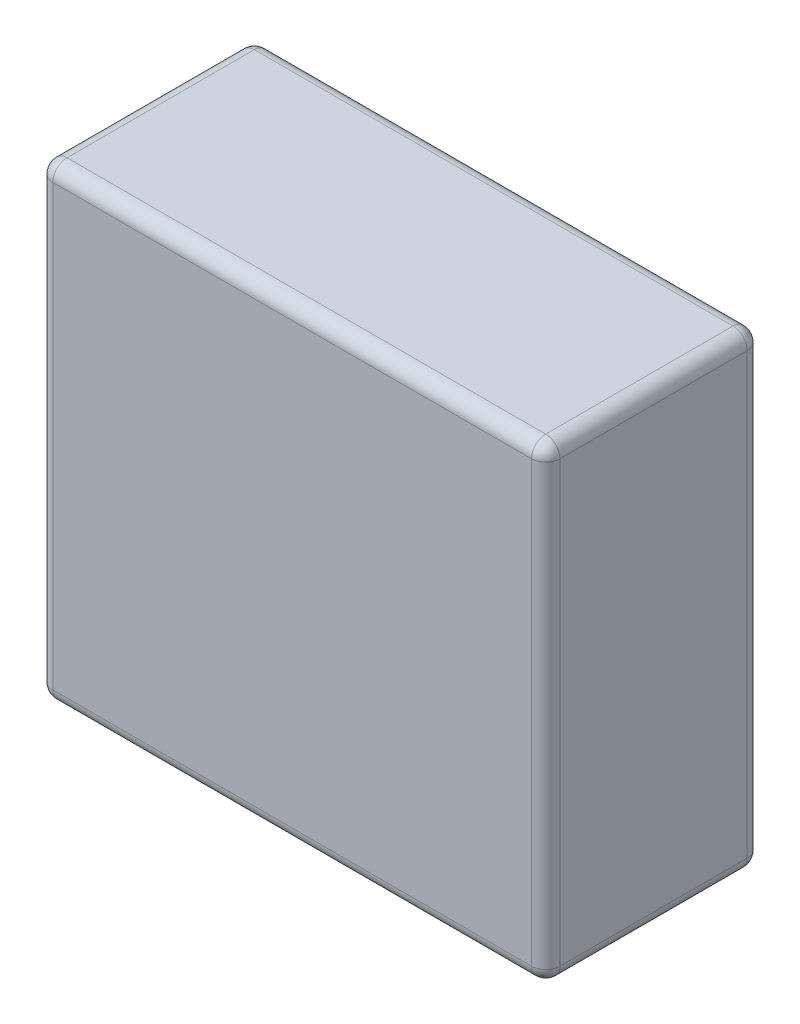
ISO-10303-21;
HEADER;
FILE_DESCRIPTION(('STEP AP214'),'2;1');
FILE_NAME('part.step','',(''),(''),'','','');
FILE_SCHEMA(('AUTOMOTIVE_DESIGN { 1 0 10303 214 1 1 1 1 }'));
ENDSEC;
DATA;
#1=APPLICATION_CONTEXT('core data for automotive mechanical design processes');
#2=APPLICATION_PROTOCOL_DEFINITION('international standard','automotive_design',2000,#1);
#3=PRODUCT_CONTEXT('',#1,'mechanical');
#4=PRODUCT('Part','Part','',(#3));
#5=PRODUCT_RELATED_PRODUCT_CATEGORY('part','',(#4));
#6=PRODUCT_DEFINITION_FORMATION('','',#4);
#7=PRODUCT_DEFINITION_CONTEXT('part definition',#1,'design');
#8=PRODUCT_DEFINITION('design','',#6,#7);
#9=PRODUCT_DEFINITION_SHAPE('','',#8);
#10=(LENGTH_UNIT() NAMED_UNIT(*) SI_UNIT(.MILLI.,.METRE.));
#11=(NAMED_UNIT(*) PLANE_ANGLE_UNIT() SI_UNIT($,.RADIAN.));
#12=(NAMED_UNIT(*) SI_UNIT($,.STERADIAN.) SOLID_ANGLE_UNIT());
#13=UNCERTAINTY_MEASURE_WITH_UNIT(LENGTH_MEASURE(1.E-05),#10,'distance_accuracy_value','');
#14=(GEOMETRIC_REPRESENTATION_CONTEXT(3) GLOBAL_UNCERTAINTY_ASSIGNED_CONTEXT((#13)) GLOBAL_UNIT_ASSIGNED_CONTEXT((#10,
#11,#12)) REPRESENTATION_CONTEXT('',''));
#15=CARTESIAN_POINT('',(0.,0.,0.));
#16=DIRECTION('',(0.,0.,1.));
#17=DIRECTION('',(1.,0.,0.));
#18=AXIS2_PLACEMENT_3D('',#15,#16,#17);
#19=CARTESIAN_POINT('',(181.,0.,0.));
#20=DIRECTION('',(0.,0.,-1.));
#21=DIRECTION('',(-1.,0.,0.));
#22=AXIS2_PLACEMENT_3D('',#19,#20,#21);
#23=PLANE('',#22);
#24=DIRECTION('',(0.,-1.,0.));
#25=VECTOR('',#24,1.);
#26=CARTESIAN_POINT('',(5.08,0.,0.));
#27=LINE('',#26,#25);
#28=CARTESIAN_POINT('',(5.08,161.92,0.));
#29=VERTEX_POINT('',#28);
#30=CARTESIAN_POINT('',(5.08,5.08,0.));
#31=VERTEX_POINT('',#30);
#32=EDGE_CURVE('E221',#29,#31,#27,.T.);
#33=ORIENTED_EDGE('',*,*,#32,.T.);
#34=DIRECTION('',(-1.,0.,0.));
#35=VECTOR('',#34,1.);
#36=CARTESIAN_POINT('',(181.,5.08,0.));
#37=LINE('',#36,#35);
#38=CARTESIAN_POINT('',(175.92,5.08,0.));
#39=VERTEX_POINT('',#38);
#40=EDGE_CURVE('E232',#31,#39,#37,.F.);
#41=ORIENTED_EDGE('',*,*,#40,.T.);
#42=DIRECTION('',(0.,-1.,0.));
#43=VECTOR('',#42,1.);
#44=CARTESIAN_POINT('',(175.92,0.,0.));
#45=LINE('',#44,#43);
#46=CARTESIAN_POINT('',(175.92,161.92,0.));
#47=VERTEX_POINT('',#46);
#48=EDGE_CURVE('E224',#39,#47,#45,.F.);
#49=ORIENTED_EDGE('',*,*,#48,.T.);
#50=DIRECTION('',(-1.,0.,0.));
#51=VECTOR('',#50,1.);
#52=CARTESIAN_POINT('',(181.,161.92,0.));
#53=LINE('',#52,#51);
#54=EDGE_CURVE('E218',#47,#29,#53,.T.);
#55=ORIENTED_EDGE('',*,*,#54,.T.);
#56=EDGE_LOOP('',(#33,#41,#49,#55));
#57=FACE_BOUND('',#56,.T.);
#58=ADVANCED_FACE('F34',(#57),#23,.F.);
#59=CARTESIAN_POINT('',(181.,0.,0.));
#60=DIRECTION('',(0.,1.,0.));
#61=DIRECTION('',(0.,0.,1.));
#62=AXIS2_PLACEMENT_3D('',#59,#60,#61);
#63=PLANE('',#62);
#64=DIRECTION('',(-1.,0.,0.));
#65=VECTOR('',#64,1.);
#66=CARTESIAN_POINT('',(181.,0.,-5.08));
#67=LINE('',#66,#65);
#68=CARTESIAN_POINT('',(175.92,0.,-5.08));
#69=VERTEX_POINT('',#68);
#70=CARTESIAN_POINT('',(5.08,0.,-5.08));
#71=VERTEX_POINT('',#70);
#72=EDGE_CURVE('E133',#69,#71,#67,.T.);
#73=ORIENTED_EDGE('',*,*,#72,.T.);
#74=DIRECTION('',(0.,0.,-1.));
#75=VECTOR('',#74,1.);
#76=CARTESIAN_POINT('',(5.08,0.,-77.));
#77=LINE('',#76,#75);
#78=CARTESIAN_POINT('',(5.08,0.,-71.92));
#79=VERTEX_POINT('',#78);
#80=EDGE_CURVE('E129',#71,#79,#77,.T.);
#81=ORIENTED_EDGE('',*,*,#80,.T.);
#82=DIRECTION('',(-1.,0.,0.));
#83=VECTOR('',#82,1.);
#84=CARTESIAN_POINT('',(181.,0.,-71.92));
#85=LINE('',#84,#83);
#86=CARTESIAN_POINT('',(175.92,0.,-71.92));
#87=VERTEX_POINT('',#86);
#88=EDGE_CURVE('E123',#79,#87,#85,.F.);
#89=ORIENTED_EDGE('',*,*,#88,.T.);
#90=DIRECTION('',(0.,0.,-1.));
#91=VECTOR('',#90,1.);
#92=CARTESIAN_POINT('',(175.92,0.,0.));
#93=LINE('',#92,#91);
#94=EDGE_CURVE('E126',#87,#69,#93,.F.);
#95=ORIENTED_EDGE('',*,*,#94,.T.);
#96=EDGE_LOOP('',(#73,#81,#89,#95));
#97=FACE_BOUND('',#96,.T.);
#98=ADVANCED_FACE('F125',(#97),#63,.F.);
#99=CARTESIAN_POINT('',(181.,0.,-77.));
#100=DIRECTION('',(0.,0.,1.));
#101=DIRECTION('',(1.,0.,0.));
#102=AXIS2_PLACEMENT_3D('',#99,#100,#101);
#103=PLANE('',#102);
#104=DIRECTION('',(0.,1.,0.));
#105=VECTOR('',#104,1.);
#106=CARTESIAN_POINT('',(175.92,0.,-77.));
#107=LINE('',#106,#105);
#108=CARTESIAN_POINT('',(175.92,161.92,-77.));
#109=VERTEX_POINT('',#108);
#110=CARTESIAN_POINT('',(175.92,5.08,-77.));
#111=VERTEX_POINT('',#110);
#112=EDGE_CURVE('E239',#109,#111,#107,.F.);
#113=ORIENTED_EDGE('',*,*,#112,.T.);
#114=DIRECTION('',(-1.,0.,0.));
#115=VECTOR('',#114,1.);
#116=CARTESIAN_POINT('',(181.,5.08,-77.));
#117=LINE('',#116,#115);
#118=CARTESIAN_POINT('',(5.08,5.08,-77.));
#119=VERTEX_POINT('',#118);
#120=EDGE_CURVE('E156',#111,#119,#117,.T.);
#121=ORIENTED_EDGE('',*,*,#120,.T.);
#122=DIRECTION('',(0.,1.,0.));
#123=VECTOR('',#122,1.);
#124=CARTESIAN_POINT('',(5.08,167.,-77.));
#125=LINE('',#124,#123);
#126=CARTESIAN_POINT('',(5.08,161.92,-77.));
#127=VERTEX_POINT('',#126);
#128=EDGE_CURVE('E235',#119,#127,#125,.T.);
#129=ORIENTED_EDGE('',*,*,#128,.T.);
#130=DIRECTION('',(-1.,0.,0.));
#131=VECTOR('',#130,1.);
#132=CARTESIAN_POINT('',(181.,161.92,-77.));
#133=LINE('',#132,#131);
#134=EDGE_CURVE('E237',#127,#109,#133,.F.);
#135=ORIENTED_EDGE('',*,*,#134,.T.);
#136=EDGE_LOOP('',(#113,#121,#129,#135));
#137=FACE_BOUND('',#136,.T.);
#138=ADVANCED_FACE('F296',(#137),#103,.F.);
#139=CARTESIAN_POINT('',(181.,167.,0.));
#140=DIRECTION('',(0.,-1.,0.));
#141=DIRECTION('',(0.,0.,-1.));
#142=AXIS2_PLACEMENT_3D('',#139,#140,#141);
#143=PLANE('',#142);
#144=DIRECTION('',(-1.,0.,0.));
#145=VECTOR('',#144,1.);
#146=CARTESIAN_POINT('',(181.,167.,-5.08));
#147=LINE('',#146,#145);
#148=CARTESIAN_POINT('',(5.08,167.,-5.08));
#149=VERTEX_POINT('',#148);
#150=CARTESIAN_POINT('',(175.92,167.,-5.08));
#151=VERTEX_POINT('',#150);
#152=EDGE_CURVE('E216',#149,#151,#147,.F.);
#153=ORIENTED_EDGE('',*,*,#152,.T.);
#154=DIRECTION('',(0.,0.,1.));
#155=VECTOR('',#154,1.);
#156=CARTESIAN_POINT('',(175.92,167.,0.));
#157=LINE('',#156,#155);
#158=CARTESIAN_POINT('',(175.92,167.,-71.92));
#159=VERTEX_POINT('',#158);
#160=EDGE_CURVE('E11',#151,#159,#157,.F.);
#161=ORIENTED_EDGE('',*,*,#160,.T.);
#162=DIRECTION('',(-1.,0.,0.));
#163=VECTOR('',#162,1.);
#164=CARTESIAN_POINT('',(181.,167.,-71.92));
#165=LINE('',#164,#163);
#166=CARTESIAN_POINT('',(5.08,167.,-71.92));
#167=VERTEX_POINT('',#166);
#168=EDGE_CURVE('E43',#159,#167,#165,.T.);
#169=ORIENTED_EDGE('',*,*,#168,.T.);
#170=DIRECTION('',(0.,0.,1.));
#171=VECTOR('',#170,1.);
#172=CARTESIAN_POINT('',(5.08,167.,0.));
#173=LINE('',#172,#171);
#174=EDGE_CURVE('E252',#167,#149,#173,.T.);
#175=ORIENTED_EDGE('',*,*,#174,.T.);
#176=EDGE_LOOP('',(#153,#161,#169,#175));
#177=FACE_BOUND('',#176,.T.);
#178=ADVANCED_FACE('F500',(#177),#143,.F.);
#179=CARTESIAN_POINT('',(181.,0.,0.));
#180=DIRECTION('',(-1.,0.,0.));
#181=DIRECTION('',(0.,0.,1.));
#182=AXIS2_PLACEMENT_3D('',#179,#180,#181);
#183=PLANE('',#182);
#184=DIRECTION('',(0.,-1.,0.));
#185=VECTOR('',#184,1.);
#186=CARTESIAN_POINT('',(181.,0.,-5.08));
#187=LINE('',#186,#185);
#188=CARTESIAN_POINT('',(181.,161.92,-5.08));
#189=VERTEX_POINT('',#188);
#190=CARTESIAN_POINT('',(181.,5.08,-5.08));
#191=VERTEX_POINT('',#190);
#192=EDGE_CURVE('E242',#189,#191,#187,.T.);
#193=ORIENTED_EDGE('',*,*,#192,.T.);
#194=DIRECTION('',(0.,0.,-1.));
#195=VECTOR('',#194,1.);
#196=CARTESIAN_POINT('',(181.,5.08,0.));
#197=LINE('',#196,#195);
#198=CARTESIAN_POINT('',(181.,5.08,-71.92));
#199=VERTEX_POINT('',#198);
#200=EDGE_CURVE('E248',#191,#199,#197,.T.);
#201=ORIENTED_EDGE('',*,*,#200,.T.);
#202=DIRECTION('',(0.,1.,0.));
#203=VECTOR('',#202,1.);
#204=CARTESIAN_POINT('',(181.,0.,-71.92));
#205=LINE('',#204,#203);
#206=CARTESIAN_POINT('',(181.,161.92,-71.92));
#207=VERTEX_POINT('',#206);
#208=EDGE_CURVE('E246',#199,#207,#205,.T.);
#209=ORIENTED_EDGE('',*,*,#208,.T.);
#210=DIRECTION('',(0.,0.,1.));
#211=VECTOR('',#210,1.);
#212=CARTESIAN_POINT('',(181.,161.92,0.));
#213=LINE('',#212,#211);
#214=EDGE_CURVE('E244',#207,#189,#213,.T.);
#215=ORIENTED_EDGE('',*,*,#214,.T.);
#216=EDGE_LOOP('',(#193,#201,#209,#215));
#217=FACE_BOUND('',#216,.T.);
#218=ADVANCED_FACE('F301',(#217),#183,.F.);
#219=CARTESIAN_POINT('',(0.,0.,0.));
#220=DIRECTION('',(-1.,0.,0.));
#221=DIRECTION('',(0.,0.,1.));
#222=AXIS2_PLACEMENT_3D('',#219,#220,#221);
#223=PLANE('',#222);
#224=DIRECTION('',(0.,1.,0.));
#225=VECTOR('',#224,1.);
#226=CARTESIAN_POINT('',(0.,0.,-71.92));
#227=LINE('',#226,#225);
#228=CARTESIAN_POINT('',(0.,161.92,-71.92));
#229=VERTEX_POINT('',#228);
#230=CARTESIAN_POINT('',(0.,5.08,-71.92));
#231=VERTEX_POINT('',#230);
#232=EDGE_CURVE('E227',#229,#231,#227,.F.);
#233=ORIENTED_EDGE('',*,*,#232,.T.);
#234=DIRECTION('',(0.,0.,-1.));
#235=VECTOR('',#234,1.);
#236=CARTESIAN_POINT('',(0.,5.08,0.));
#237=LINE('',#236,#235);
#238=CARTESIAN_POINT('',(0.,5.08,-5.08));
#239=VERTEX_POINT('',#238);
#240=EDGE_CURVE('E222',#231,#239,#237,.F.);
#241=ORIENTED_EDGE('',*,*,#240,.T.);
#242=DIRECTION('',(0.,-1.,0.));
#243=VECTOR('',#242,1.);
#244=CARTESIAN_POINT('',(0.,167.,-5.08));
#245=LINE('',#244,#243);
#246=CARTESIAN_POINT('',(0.,161.92,-5.08));
#247=VERTEX_POINT('',#246);
#248=EDGE_CURVE('E275',#239,#247,#245,.F.);
#249=ORIENTED_EDGE('',*,*,#248,.T.);
#250=DIRECTION('',(0.,0.,1.));
#251=VECTOR('',#250,1.);
#252=CARTESIAN_POINT('',(0.,161.92,-77.));
#253=LINE('',#252,#251);
#254=EDGE_CURVE('E279',#247,#229,#253,.F.);
#255=ORIENTED_EDGE('',*,*,#254,.T.);
#256=EDGE_LOOP('',(#233,#241,#249,#255));
#257=FACE_BOUND('',#256,.T.);
#258=ADVANCED_FACE('F282',(#257),#223,.T.);
#259=CARTESIAN_POINT('',(175.92,161.92,0.));
#260=DIRECTION('',(0.,0.,1.));
#261=DIRECTION('',(1.,0.,0.));
#262=AXIS2_PLACEMENT_3D('',#259,#260,#261);
#263=CYLINDRICAL_SURFACE('',#262,5.08);
#264=CARTESIAN_POINT('',(175.92,161.92,-5.08));
#265=DIRECTION('',(0.,0.,1.));
#266=DIRECTION('',(1.,0.,0.));
#267=AXIS2_PLACEMENT_3D('',#264,#265,#266);
#268=CIRCLE('',#267,5.08);
#269=EDGE_CURVE('E38',#189,#151,#268,.T.);
#270=ORIENTED_EDGE('',*,*,#269,.F.);
#271=ORIENTED_EDGE('',*,*,#214,.F.);
#272=CARTESIAN_POINT('',(175.92,161.92,-71.92));
#273=DIRECTION('',(0.,0.,-1.));
#274=DIRECTION('',(-1.,0.,0.));
#275=AXIS2_PLACEMENT_3D('',#272,#273,#274);
#276=CIRCLE('',#275,5.08);
#277=EDGE_CURVE('E196',#159,#207,#276,.T.);
#278=ORIENTED_EDGE('',*,*,#277,.F.);
#279=ORIENTED_EDGE('',*,*,#160,.F.);
#280=EDGE_LOOP('',(#270,#271,#278,#279));
#281=FACE_BOUND('',#280,.T.);
#282=ADVANCED_FACE('F36',(#281),#263,.T.);
#283=CARTESIAN_POINT('',(175.92,161.92,-5.08));
#284=DIRECTION('',(0.,0.,1.));
#285=DIRECTION('',(1.,0.,0.));
#286=AXIS2_PLACEMENT_3D('',#283,#284,#285);
#287=SPHERICAL_SURFACE('',#286,5.08);
#288=CARTESIAN_POINT('',(175.92,161.92,-5.08));
#289=DIRECTION('',(0.,1.,0.));
#290=DIRECTION('',(0.,0.,1.));
#291=AXIS2_PLACEMENT_3D('',#288,#289,#290);
#292=CIRCLE('',#291,5.08);
#293=EDGE_CURVE('E191',#189,#47,#292,.F.);
#294=ORIENTED_EDGE('',*,*,#293,.F.);
#295=ORIENTED_EDGE('',*,*,#269,.T.);
#296=CARTESIAN_POINT('',(175.92,161.92,-5.08));
#297=DIRECTION('',(1.,0.,0.));
#298=DIRECTION('',(0.,0.,-1.));
#299=AXIS2_PLACEMENT_3D('',#296,#297,#298);
#300=CIRCLE('',#299,5.08);
#301=EDGE_CURVE('E194',#47,#151,#300,.F.);
#302=ORIENTED_EDGE('',*,*,#301,.F.);
#303=EDGE_LOOP('',(#294,#295,#302));
#304=FACE_BOUND('',#303,.T.);
#305=ADVANCED_FACE('F206',(#304),#287,.T.);
#306=CARTESIAN_POINT('',(175.92,161.92,-71.92));
#307=DIRECTION('',(0.,0.,1.));
#308=DIRECTION('',(1.,0.,0.));
#309=AXIS2_PLACEMENT_3D('',#306,#307,#308);
#310=SPHERICAL_SURFACE('',#309,5.08);
#311=CARTESIAN_POINT('',(175.92,161.92,-71.92));
#312=DIRECTION('',(1.,0.,0.));
#313=DIRECTION('',(0.,0.,-1.));
#314=AXIS2_PLACEMENT_3D('',#311,#312,#313);
#315=CIRCLE('',#314,5.08);
#316=EDGE_CURVE('E186',#159,#109,#315,.F.);
#317=ORIENTED_EDGE('',*,*,#316,.F.);
#318=ORIENTED_EDGE('',*,*,#277,.T.);
#319=CARTESIAN_POINT('',(175.92,161.92,-71.92));
#320=DIRECTION('',(0.,1.,0.));
#321=DIRECTION('',(0.,0.,1.));
#322=AXIS2_PLACEMENT_3D('',#319,#320,#321);
#323=CIRCLE('',#322,5.08);
#324=EDGE_CURVE('E188',#109,#207,#323,.F.);
#325=ORIENTED_EDGE('',*,*,#324,.F.);
#326=EDGE_LOOP('',(#317,#318,#325));
#327=FACE_BOUND('',#326,.T.);
#328=ADVANCED_FACE('F321',(#327),#310,.T.);
#329=CARTESIAN_POINT('',(181.,161.92,-5.08));
#330=DIRECTION('',(-1.,0.,0.));
#331=DIRECTION('',(0.,0.,1.));
#332=AXIS2_PLACEMENT_3D('',#329,#330,#331);
#333=CYLINDRICAL_SURFACE('',#332,5.08);
#334=ORIENTED_EDGE('',*,*,#301,.T.);
#335=ORIENTED_EDGE('',*,*,#152,.F.);
#336=CARTESIAN_POINT('',(5.08,161.92,-5.08));
#337=DIRECTION('',(-1.,0.,0.));
#338=DIRECTION('',(0.,0.,1.));
#339=AXIS2_PLACEMENT_3D('',#336,#337,#338);
#340=CIRCLE('',#339,5.08);
#341=EDGE_CURVE('E180',#29,#149,#340,.T.);
#342=ORIENTED_EDGE('',*,*,#341,.F.);
#343=ORIENTED_EDGE('',*,*,#54,.F.);
#344=EDGE_LOOP('',(#334,#335,#342,#343));
#345=FACE_BOUND('',#344,.T.);
#346=ADVANCED_FACE('F214',(#345),#333,.T.);
#347=CARTESIAN_POINT('',(175.92,0.,-5.08));
#348=DIRECTION('',(0.,-1.,0.));
#349=DIRECTION('',(0.,0.,-1.));
#350=AXIS2_PLACEMENT_3D('',#347,#348,#349);
#351=CYLINDRICAL_SURFACE('',#350,5.08);
#352=ORIENTED_EDGE('',*,*,#293,.T.);
#353=ORIENTED_EDGE('',*,*,#48,.F.);
#354=CARTESIAN_POINT('',(175.92,5.08,-5.08));
#355=DIRECTION('',(0.,-1.,0.));
#356=DIRECTION('',(0.,0.,-1.));
#357=AXIS2_PLACEMENT_3D('',#354,#355,#356);
#358=CIRCLE('',#357,5.08);
#359=EDGE_CURVE('E177',#191,#39,#358,.T.);
#360=ORIENTED_EDGE('',*,*,#359,.F.);
#361=ORIENTED_EDGE('',*,*,#192,.F.);
#362=EDGE_LOOP('',(#352,#353,#360,#361));
#363=FACE_BOUND('',#362,.T.);
#364=ADVANCED_FACE('F305',(#363),#351,.T.);
#365=CARTESIAN_POINT('',(175.92,5.08,0.));
#366=DIRECTION('',(0.,0.,-1.));
#367=DIRECTION('',(-1.,0.,0.));
#368=AXIS2_PLACEMENT_3D('',#365,#366,#367);
#369=CYLINDRICAL_SURFACE('',#368,5.08);
#370=CARTESIAN_POINT('',(175.92,5.08,-71.92));
#371=DIRECTION('',(0.,0.,-1.));
#372=DIRECTION('',(-1.,0.,0.));
#373=AXIS2_PLACEMENT_3D('',#370,#371,#372);
#374=CIRCLE('',#373,5.08);
#375=EDGE_CURVE('E140',#199,#87,#374,.T.);
#376=ORIENTED_EDGE('',*,*,#375,.F.);
#377=ORIENTED_EDGE('',*,*,#200,.F.);
#378=CARTESIAN_POINT('',(175.92,5.08,-5.08));
#379=DIRECTION('',(0.,0.,1.));
#380=DIRECTION('',(1.,0.,0.));
#381=AXIS2_PLACEMENT_3D('',#378,#379,#380);
#382=CIRCLE('',#381,5.08);
#383=EDGE_CURVE('E143',#69,#191,#382,.T.);
#384=ORIENTED_EDGE('',*,*,#383,.F.);
#385=ORIENTED_EDGE('',*,*,#94,.F.);
#386=EDGE_LOOP('',(#376,#377,#384,#385));
#387=FACE_BOUND('',#386,.T.);
#388=ADVANCED_FACE('F138',(#387),#369,.T.);
#389=CARTESIAN_POINT('',(175.92,0.,-71.92));
#390=DIRECTION('',(0.,1.,0.));
#391=DIRECTION('',(0.,0.,1.));
#392=AXIS2_PLACEMENT_3D('',#389,#390,#391);
#393=CYLINDRICAL_SURFACE('',#392,5.08);
#394=ORIENTED_EDGE('',*,*,#324,.T.);
#395=ORIENTED_EDGE('',*,*,#208,.F.);
#396=CARTESIAN_POINT('',(175.92,5.08,-71.92));
#397=DIRECTION('',(0.,-1.,0.));
#398=DIRECTION('',(0.,0.,-1.));
#399=AXIS2_PLACEMENT_3D('',#396,#397,#398);
#400=CIRCLE('',#399,5.08);
#401=EDGE_CURVE('E152',#111,#199,#400,.T.);
#402=ORIENTED_EDGE('',*,*,#401,.F.);
#403=ORIENTED_EDGE('',*,*,#112,.F.);
#404=EDGE_LOOP('',(#394,#395,#402,#403));
#405=FACE_BOUND('',#404,.T.);
#406=ADVANCED_FACE('F299',(#405),#393,.T.);
#407=CARTESIAN_POINT('',(181.,161.92,-71.92));
#408=DIRECTION('',(-1.,0.,0.));
#409=DIRECTION('',(0.,0.,1.));
#410=AXIS2_PLACEMENT_3D('',#407,#408,#409);
#411=CYLINDRICAL_SURFACE('',#410,5.08);
#412=ORIENTED_EDGE('',*,*,#316,.T.);
#413=ORIENTED_EDGE('',*,*,#134,.F.);
#414=CARTESIAN_POINT('',(5.08,161.92,-71.92));
#415=DIRECTION('',(-1.,0.,0.));
#416=DIRECTION('',(0.,0.,1.));
#417=AXIS2_PLACEMENT_3D('',#414,#415,#416);
#418=CIRCLE('',#417,5.08);
#419=EDGE_CURVE('E172',#167,#127,#418,.T.);
#420=ORIENTED_EDGE('',*,*,#419,.F.);
#421=ORIENTED_EDGE('',*,*,#168,.F.);
#422=EDGE_LOOP('',(#412,#413,#420,#421));
#423=FACE_BOUND('',#422,.T.);
#424=ADVANCED_FACE('F320',(#423),#411,.T.);
#425=CARTESIAN_POINT('',(5.08,161.92,0.));
#426=DIRECTION('',(0.,0.,-1.));
#427=DIRECTION('',(-1.,0.,0.));
#428=AXIS2_PLACEMENT_3D('',#425,#426,#427);
#429=CYLINDRICAL_SURFACE('',#428,5.08);
#430=CARTESIAN_POINT('',(5.08,161.92,-5.08));
#431=DIRECTION('',(0.,0.,1.));
#432=DIRECTION('',(1.,0.,0.));
#433=AXIS2_PLACEMENT_3D('',#430,#431,#432);
#434=CIRCLE('',#433,5.08);
#435=EDGE_CURVE('E183',#149,#247,#434,.T.);
#436=ORIENTED_EDGE('',*,*,#435,.F.);
#437=ORIENTED_EDGE('',*,*,#174,.F.);
#438=CARTESIAN_POINT('',(5.08,161.92,-71.92));
#439=DIRECTION('',(0.,0.,-1.));
#440=DIRECTION('',(-1.,0.,0.));
#441=AXIS2_PLACEMENT_3D('',#438,#439,#440);
#442=CIRCLE('',#441,5.08);
#443=EDGE_CURVE('E169',#229,#167,#442,.T.);
#444=ORIENTED_EDGE('',*,*,#443,.F.);
#445=ORIENTED_EDGE('',*,*,#254,.F.);
#446=EDGE_LOOP('',(#436,#437,#444,#445));
#447=FACE_BOUND('',#446,.T.);
#448=ADVANCED_FACE('F317',(#447),#429,.T.);
#449=CARTESIAN_POINT('',(5.08,161.92,-5.08));
#450=DIRECTION('',(0.,0.,1.));
#451=DIRECTION('',(1.,0.,0.));
#452=AXIS2_PLACEMENT_3D('',#449,#450,#451);
#453=SPHERICAL_SURFACE('',#452,5.08);
#454=ORIENTED_EDGE('',*,*,#341,.T.);
#455=ORIENTED_EDGE('',*,*,#435,.T.);
#456=CARTESIAN_POINT('',(5.08,161.92,-5.08));
#457=DIRECTION('',(0.,1.,0.));
#458=DIRECTION('',(0.,0.,1.));
#459=AXIS2_PLACEMENT_3D('',#456,#457,#458);
#460=CIRCLE('',#459,5.08);
#461=EDGE_CURVE('E160',#29,#247,#460,.F.);
#462=ORIENTED_EDGE('',*,*,#461,.F.);
#463=EDGE_LOOP('',(#454,#455,#462));
#464=FACE_BOUND('',#463,.T.);
#465=ADVANCED_FACE('F357',(#464),#453,.T.);
#466=CARTESIAN_POINT('',(175.92,5.08,-5.08));
#467=DIRECTION('',(0.,0.,1.));
#468=DIRECTION('',(1.,0.,0.));
#469=AXIS2_PLACEMENT_3D('',#466,#467,#468);
#470=SPHERICAL_SURFACE('',#469,5.08);
#471=ORIENTED_EDGE('',*,*,#383,.T.);
#472=ORIENTED_EDGE('',*,*,#359,.T.);
#473=CARTESIAN_POINT('',(175.92,5.08,-5.08));
#474=DIRECTION('',(1.,0.,0.));
#475=DIRECTION('',(0.,0.,-1.));
#476=AXIS2_PLACEMENT_3D('',#473,#474,#475);
#477=CIRCLE('',#476,5.08);
#478=EDGE_CURVE('E157',#69,#39,#477,.F.);
#479=ORIENTED_EDGE('',*,*,#478,.F.);
#480=EDGE_LOOP('',(#471,#472,#479));
#481=FACE_BOUND('',#480,.T.);
#482=ADVANCED_FACE('F307',(#481),#470,.T.);
#483=CARTESIAN_POINT('',(175.92,5.08,-71.92));
#484=DIRECTION('',(0.,0.,1.));
#485=DIRECTION('',(1.,0.,0.));
#486=AXIS2_PLACEMENT_3D('',#483,#484,#485);
#487=SPHERICAL_SURFACE('',#486,5.08);
#488=ORIENTED_EDGE('',*,*,#401,.T.);
#489=ORIENTED_EDGE('',*,*,#375,.T.);
#490=CARTESIAN_POINT('',(175.92,5.08,-71.92));
#491=DIRECTION('',(1.,0.,0.));
#492=DIRECTION('',(0.,0.,-1.));
#493=AXIS2_PLACEMENT_3D('',#490,#491,#492);
#494=CIRCLE('',#493,5.08);
#495=EDGE_CURVE('E149',#111,#87,#494,.F.);
#496=ORIENTED_EDGE('',*,*,#495,.F.);
#497=EDGE_LOOP('',(#488,#489,#496));
#498=FACE_BOUND('',#497,.T.);
#499=ADVANCED_FACE('F148',(#498),#487,.T.);
#500=CARTESIAN_POINT('',(5.08,161.92,-71.92));
#501=DIRECTION('',(0.,0.,1.));
#502=DIRECTION('',(1.,0.,0.));
#503=AXIS2_PLACEMENT_3D('',#500,#501,#502);
#504=SPHERICAL_SURFACE('',#503,5.08);
#505=ORIENTED_EDGE('',*,*,#443,.T.);
#506=ORIENTED_EDGE('',*,*,#419,.T.);
#507=CARTESIAN_POINT('',(5.08,161.92,-71.92));
#508=DIRECTION('',(0.,1.,0.));
#509=DIRECTION('',(0.,0.,1.));
#510=AXIS2_PLACEMENT_3D('',#507,#508,#509);
#511=CIRCLE('',#510,5.08);
#512=EDGE_CURVE('E158',#229,#127,#511,.F.);
#513=ORIENTED_EDGE('',*,*,#512,.F.);
#514=EDGE_LOOP('',(#505,#506,#513));
#515=FACE_BOUND('',#514,.T.);
#516=ADVANCED_FACE('F319',(#515),#504,.T.);
#517=CARTESIAN_POINT('',(5.08,0.,-5.08));
#518=DIRECTION('',(0.,1.,0.));
#519=DIRECTION('',(0.,0.,1.));
#520=AXIS2_PLACEMENT_3D('',#517,#518,#519);
#521=CYLINDRICAL_SURFACE('',#520,5.08);
#522=ORIENTED_EDGE('',*,*,#461,.T.);
#523=ORIENTED_EDGE('',*,*,#248,.F.);
#524=CARTESIAN_POINT('',(5.08,5.08,-5.08));
#525=DIRECTION('',(0.,-1.,0.));
#526=DIRECTION('',(0.,0.,-1.));
#527=AXIS2_PLACEMENT_3D('',#524,#525,#526);
#528=CIRCLE('',#527,5.08);
#529=EDGE_CURVE('E163',#31,#239,#528,.T.);
#530=ORIENTED_EDGE('',*,*,#529,.F.);
#531=ORIENTED_EDGE('',*,*,#32,.F.);
#532=EDGE_LOOP('',(#522,#523,#530,#531));
#533=FACE_BOUND('',#532,.T.);
#534=ADVANCED_FACE('F276',(#533),#521,.T.);
#535=CARTESIAN_POINT('',(181.,5.08,-5.08));
#536=DIRECTION('',(-1.,0.,0.));
#537=DIRECTION('',(0.,0.,1.));
#538=AXIS2_PLACEMENT_3D('',#535,#536,#537);
#539=CYLINDRICAL_SURFACE('',#538,5.08);
#540=ORIENTED_EDGE('',*,*,#478,.T.);
#541=ORIENTED_EDGE('',*,*,#40,.F.);
#542=CARTESIAN_POINT('',(5.08,5.08,-5.08));
#543=DIRECTION('',(-1.,0.,0.));
#544=DIRECTION('',(0.,0.,1.));
#545=AXIS2_PLACEMENT_3D('',#542,#543,#544);
#546=CIRCLE('',#545,5.08);
#547=EDGE_CURVE('E264',#71,#31,#546,.T.);
#548=ORIENTED_EDGE('',*,*,#547,.F.);
#549=ORIENTED_EDGE('',*,*,#72,.F.);
#550=EDGE_LOOP('',(#540,#541,#548,#549));
#551=FACE_BOUND('',#550,.T.);
#552=ADVANCED_FACE('F311',(#551),#539,.T.);
#553=CARTESIAN_POINT('',(181.,5.08,-71.92));
#554=DIRECTION('',(-1.,0.,0.));
#555=DIRECTION('',(0.,0.,1.));
#556=AXIS2_PLACEMENT_3D('',#553,#554,#555);
#557=CYLINDRICAL_SURFACE('',#556,5.08);
#558=ORIENTED_EDGE('',*,*,#495,.T.);
#559=ORIENTED_EDGE('',*,*,#88,.F.);
#560=CARTESIAN_POINT('',(5.08,5.08,-71.92));
#561=DIRECTION('',(-1.,0.,0.));
#562=DIRECTION('',(0.,0.,1.));
#563=AXIS2_PLACEMENT_3D('',#560,#561,#562);
#564=CIRCLE('',#563,5.08);
#565=EDGE_CURVE('E261',#119,#79,#564,.T.);
#566=ORIENTED_EDGE('',*,*,#565,.F.);
#567=ORIENTED_EDGE('',*,*,#120,.F.);
#568=EDGE_LOOP('',(#558,#559,#566,#567));
#569=FACE_BOUND('',#568,.T.);
#570=ADVANCED_FACE('F154',(#569),#557,.T.);
#571=CARTESIAN_POINT('',(5.08,0.,-71.92));
#572=DIRECTION('',(0.,-1.,0.));
#573=DIRECTION('',(0.,0.,-1.));
#574=AXIS2_PLACEMENT_3D('',#571,#572,#573);
#575=CYLINDRICAL_SURFACE('',#574,5.08);
#576=ORIENTED_EDGE('',*,*,#512,.T.);
#577=ORIENTED_EDGE('',*,*,#128,.F.);
#578=CARTESIAN_POINT('',(5.08,5.08,-71.92));
#579=DIRECTION('',(0.,-1.,0.));
#580=DIRECTION('',(0.,0.,-1.));
#581=AXIS2_PLACEMENT_3D('',#578,#579,#580);
#582=CIRCLE('',#581,5.08);
#583=EDGE_CURVE('E259',#231,#119,#582,.T.);
#584=ORIENTED_EDGE('',*,*,#583,.F.);
#585=ORIENTED_EDGE('',*,*,#232,.F.);
#586=EDGE_LOOP('',(#576,#577,#584,#585));
#587=FACE_BOUND('',#586,.T.);
#588=ADVANCED_FACE('F292',(#587),#575,.T.);
#589=CARTESIAN_POINT('',(5.08,5.08,-5.08));
#590=DIRECTION('',(0.,0.,1.));
#591=DIRECTION('',(1.,0.,0.));
#592=AXIS2_PLACEMENT_3D('',#589,#590,#591);
#593=SPHERICAL_SURFACE('',#592,5.08);
#594=ORIENTED_EDGE('',*,*,#547,.T.);
#595=ORIENTED_EDGE('',*,*,#529,.T.);
#596=CARTESIAN_POINT('',(5.08,5.08,-5.08));
#597=DIRECTION('',(0.,0.,1.));
#598=DIRECTION('',(1.,0.,0.));
#599=AXIS2_PLACEMENT_3D('',#596,#597,#598);
#600=CIRCLE('',#599,5.08);
#601=EDGE_CURVE('E257',#71,#239,#600,.F.);
#602=ORIENTED_EDGE('',*,*,#601,.F.);
#603=EDGE_LOOP('',(#594,#595,#602));
#604=FACE_BOUND('',#603,.T.);
#605=ADVANCED_FACE('F271',(#604),#593,.T.);
#606=CARTESIAN_POINT('',(5.08,5.08,-71.92));
#607=DIRECTION('',(0.,0.,1.));
#608=DIRECTION('',(1.,0.,0.));
#609=AXIS2_PLACEMENT_3D('',#606,#607,#608);
#610=SPHERICAL_SURFACE('',#609,5.08);
#611=ORIENTED_EDGE('',*,*,#583,.T.);
#612=ORIENTED_EDGE('',*,*,#565,.T.);
#613=CARTESIAN_POINT('',(5.08,5.08,-71.92));
#614=DIRECTION('',(0.,0.,-1.));
#615=DIRECTION('',(-1.,0.,0.));
#616=AXIS2_PLACEMENT_3D('',#613,#614,#615);
#617=CIRCLE('',#616,5.08);
#618=EDGE_CURVE('E255',#231,#79,#617,.F.);
#619=ORIENTED_EDGE('',*,*,#618,.F.);
#620=EDGE_LOOP('',(#611,#612,#619));
#621=FACE_BOUND('',#620,.T.);
#622=ADVANCED_FACE('F289',(#621),#610,.T.);
#623=CARTESIAN_POINT('',(5.08,5.08,0.));
#624=DIRECTION('',(0.,0.,1.));
#625=DIRECTION('',(1.,0.,0.));
#626=AXIS2_PLACEMENT_3D('',#623,#624,#625);
#627=CYLINDRICAL_SURFACE('',#626,5.08);
#628=ORIENTED_EDGE('',*,*,#601,.T.);
#629=ORIENTED_EDGE('',*,*,#240,.F.);
#630=ORIENTED_EDGE('',*,*,#618,.T.);
#631=ORIENTED_EDGE('',*,*,#80,.F.);
#632=EDGE_LOOP('',(#628,#629,#630,#631));
#633=FACE_BOUND('',#632,.T.);
#634=ADVANCED_FACE('F287',(#633),#627,.T.);
#635=CLOSED_SHELL('',(#58,#98,#138,#178,#218,#258,#282,#305,#328,#346,#364,#388,#406,#424,#448,
#465,#482,#499,#516,#534,#552,#570,#588,#605,#622,#634));
#636=MANIFOLD_SOLID_BREP('B2',#635);
#637=ADVANCED_BREP_SHAPE_REPRESENTATION('',(#18,#636),#14);
#638=SHAPE_DEFINITION_REPRESENTATION(#9,#637);
ENDSEC;
END-ISO-10303-21;
